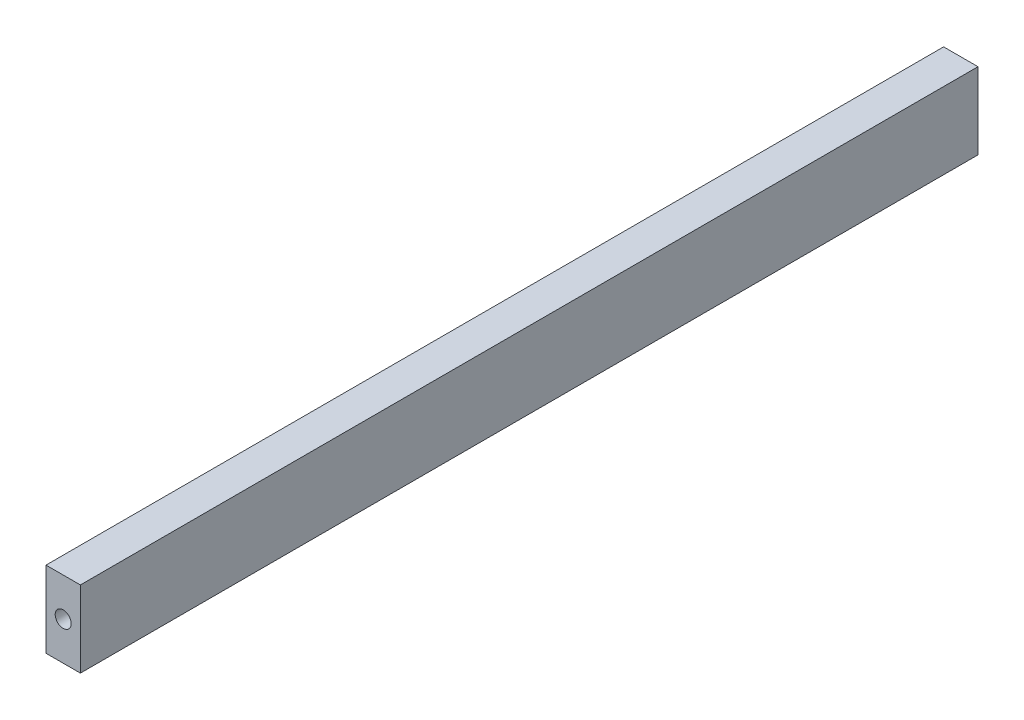
ISO-10303-21;
HEADER;
FILE_DESCRIPTION(('STEP AP214'),'2;1');
FILE_NAME('part.step','',(''),(''),'','','');
FILE_SCHEMA(('AUTOMOTIVE_DESIGN { 1 0 10303 214 1 1 1 1 }'));
ENDSEC;
DATA;
#1=APPLICATION_CONTEXT('core data for automotive mechanical design processes');
#2=APPLICATION_PROTOCOL_DEFINITION('international standard','automotive_design',2000,#1);
#3=PRODUCT_CONTEXT('',#1,'mechanical');
#4=PRODUCT('Part','Part','',(#3));
#5=PRODUCT_RELATED_PRODUCT_CATEGORY('part','',(#4));
#6=PRODUCT_DEFINITION_FORMATION('','',#4);
#7=PRODUCT_DEFINITION_CONTEXT('part definition',#1,'design');
#8=PRODUCT_DEFINITION('design','',#6,#7);
#9=PRODUCT_DEFINITION_SHAPE('','',#8);
#10=(LENGTH_UNIT() NAMED_UNIT(*) SI_UNIT(.MILLI.,.METRE.));
#11=(NAMED_UNIT(*) PLANE_ANGLE_UNIT() SI_UNIT($,.RADIAN.));
#12=(NAMED_UNIT(*) SI_UNIT($,.STERADIAN.) SOLID_ANGLE_UNIT());
#13=UNCERTAINTY_MEASURE_WITH_UNIT(LENGTH_MEASURE(1.E-05),#10,'distance_accuracy_value','');
#14=(GEOMETRIC_REPRESENTATION_CONTEXT(3) GLOBAL_UNCERTAINTY_ASSIGNED_CONTEXT((#13)) GLOBAL_UNIT_ASSIGNED_CONTEXT((#10,
#11,#12)) REPRESENTATION_CONTEXT('',''));
#15=CARTESIAN_POINT('',(0.,0.,0.));
#16=DIRECTION('',(0.,0.,1.));
#17=DIRECTION('',(1.,0.,0.));
#18=AXIS2_PLACEMENT_3D('',#15,#16,#17);
#19=CARTESIAN_POINT('',(4.5,-10.,117.5));
#20=DIRECTION('',(-1.,0.,0.));
#21=DIRECTION('',(0.,0.,1.));
#22=AXIS2_PLACEMENT_3D('',#19,#20,#21);
#23=PLANE('',#22);
#24=DIRECTION('',(0.,1.,0.));
#25=VECTOR('',#24,1.);
#26=CARTESIAN_POINT('',(4.5,-10.,-117.5));
#27=LINE('',#26,#25);
#28=CARTESIAN_POINT('',(4.5,-10.,-117.5));
#29=VERTEX_POINT('',#28);
#30=CARTESIAN_POINT('',(4.5,10.,-117.5));
#31=VERTEX_POINT('',#30);
#32=EDGE_CURVE('E111',#29,#31,#27,.T.);
#33=ORIENTED_EDGE('',*,*,#32,.T.);
#34=DIRECTION('',(0.,0.,-1.));
#35=VECTOR('',#34,1.);
#36=CARTESIAN_POINT('',(4.5,10.,117.5));
#37=LINE('',#36,#35);
#38=CARTESIAN_POINT('',(4.5,10.,117.5));
#39=VERTEX_POINT('',#38);
#40=EDGE_CURVE('E11',#39,#31,#37,.T.);
#41=ORIENTED_EDGE('',*,*,#40,.F.);
#42=DIRECTION('',(0.,1.,0.));
#43=VECTOR('',#42,1.);
#44=CARTESIAN_POINT('',(4.5,-10.,117.5));
#45=LINE('',#44,#43);
#46=CARTESIAN_POINT('',(4.5,-10.,117.5));
#47=VERTEX_POINT('',#46);
#48=EDGE_CURVE('E95',#47,#39,#45,.T.);
#49=ORIENTED_EDGE('',*,*,#48,.F.);
#50=DIRECTION('',(0.,0.,-1.));
#51=VECTOR('',#50,1.);
#52=CARTESIAN_POINT('',(4.5,-10.,117.5));
#53=LINE('',#52,#51);
#54=EDGE_CURVE('E107',#47,#29,#53,.T.);
#55=ORIENTED_EDGE('',*,*,#54,.T.);
#56=EDGE_LOOP('',(#33,#41,#49,#55));
#57=FACE_BOUND('',#56,.T.);
#58=ADVANCED_FACE('F43',(#57),#23,.F.);
#59=CARTESIAN_POINT('',(-4.5,10.,117.5));
#60=DIRECTION('',(0.,-1.,0.));
#61=DIRECTION('',(0.,0.,-1.));
#62=AXIS2_PLACEMENT_3D('',#59,#60,#61);
#63=PLANE('',#62);
#64=DIRECTION('',(-1.,0.,0.));
#65=VECTOR('',#64,1.);
#66=CARTESIAN_POINT('',(-4.5,10.,-117.5));
#67=LINE('',#66,#65);
#68=CARTESIAN_POINT('',(-4.5,10.,-117.5));
#69=VERTEX_POINT('',#68);
#70=EDGE_CURVE('E100',#31,#69,#67,.T.);
#71=ORIENTED_EDGE('',*,*,#70,.T.);
#72=DIRECTION('',(0.,0.,-1.));
#73=VECTOR('',#72,1.);
#74=CARTESIAN_POINT('',(-4.5,10.,117.5));
#75=LINE('',#74,#73);
#76=CARTESIAN_POINT('',(-4.5,10.,117.5));
#77=VERTEX_POINT('',#76);
#78=EDGE_CURVE('E52',#77,#69,#75,.T.);
#79=ORIENTED_EDGE('',*,*,#78,.F.);
#80=DIRECTION('',(-1.,0.,0.));
#81=VECTOR('',#80,1.);
#82=CARTESIAN_POINT('',(-4.5,10.,117.5));
#83=LINE('',#82,#81);
#84=EDGE_CURVE('E90',#39,#77,#83,.T.);
#85=ORIENTED_EDGE('',*,*,#84,.F.);
#86=ORIENTED_EDGE('',*,*,#40,.T.);
#87=EDGE_LOOP('',(#71,#79,#85,#86));
#88=FACE_BOUND('',#87,.T.);
#89=ADVANCED_FACE('F99',(#88),#63,.F.);
#90=CARTESIAN_POINT('',(-4.5,-10.,117.5));
#91=DIRECTION('',(1.,0.,0.));
#92=DIRECTION('',(0.,0.,-1.));
#93=AXIS2_PLACEMENT_3D('',#90,#91,#92);
#94=PLANE('',#93);
#95=DIRECTION('',(0.,-1.,0.));
#96=VECTOR('',#95,1.);
#97=CARTESIAN_POINT('',(-4.5,-10.,-117.5));
#98=LINE('',#97,#96);
#99=CARTESIAN_POINT('',(-4.5,-10.,-117.5));
#100=VERTEX_POINT('',#99);
#101=EDGE_CURVE('E77',#69,#100,#98,.T.);
#102=ORIENTED_EDGE('',*,*,#101,.T.);
#103=DIRECTION('',(0.,0.,-1.));
#104=VECTOR('',#103,1.);
#105=CARTESIAN_POINT('',(-4.5,-10.,117.5));
#106=LINE('',#105,#104);
#107=CARTESIAN_POINT('',(-4.5,-10.,117.5));
#108=VERTEX_POINT('',#107);
#109=EDGE_CURVE('E102',#108,#100,#106,.T.);
#110=ORIENTED_EDGE('',*,*,#109,.F.);
#111=DIRECTION('',(0.,-1.,0.));
#112=VECTOR('',#111,1.);
#113=CARTESIAN_POINT('',(-4.5,-10.,117.5));
#114=LINE('',#113,#112);
#115=EDGE_CURVE('E93',#77,#108,#114,.T.);
#116=ORIENTED_EDGE('',*,*,#115,.F.);
#117=ORIENTED_EDGE('',*,*,#78,.T.);
#118=EDGE_LOOP('',(#102,#110,#116,#117));
#119=FACE_BOUND('',#118,.T.);
#120=ADVANCED_FACE('F103',(#119),#94,.F.);
#121=CARTESIAN_POINT('',(-4.5,-10.,117.5));
#122=DIRECTION('',(0.,1.,0.));
#123=DIRECTION('',(0.,0.,1.));
#124=AXIS2_PLACEMENT_3D('',#121,#122,#123);
#125=PLANE('',#124);
#126=DIRECTION('',(1.,0.,0.));
#127=VECTOR('',#126,1.);
#128=CARTESIAN_POINT('',(-4.5,-10.,-117.5));
#129=LINE('',#128,#127);
#130=EDGE_CURVE('E83',#100,#29,#129,.T.);
#131=ORIENTED_EDGE('',*,*,#130,.T.);
#132=ORIENTED_EDGE('',*,*,#54,.F.);
#133=DIRECTION('',(1.,0.,0.));
#134=VECTOR('',#133,1.);
#135=CARTESIAN_POINT('',(-4.5,-10.,117.5));
#136=LINE('',#135,#134);
#137=EDGE_CURVE('E60',#108,#47,#136,.T.);
#138=ORIENTED_EDGE('',*,*,#137,.F.);
#139=ORIENTED_EDGE('',*,*,#109,.T.);
#140=EDGE_LOOP('',(#131,#132,#138,#139));
#141=FACE_BOUND('',#140,.T.);
#142=ADVANCED_FACE('F125',(#141),#125,.F.);
#143=CARTESIAN_POINT('',(0.,0.,117.5));
#144=DIRECTION('',(0.,0.,-1.));
#145=DIRECTION('',(-1.,0.,0.));
#146=AXIS2_PLACEMENT_3D('',#143,#144,#145);
#147=PLANE('',#146);
#148=CARTESIAN_POINT('',(0.,0.,117.5));
#149=DIRECTION('',(0.,0.,1.));
#150=DIRECTION('',(1.,0.,0.));
#151=AXIS2_PLACEMENT_3D('',#148,#149,#150);
#152=CIRCLE('',#151,2.1);
#153=CARTESIAN_POINT('',(2.1,0.,117.5));
#154=VERTEX_POINT('',#153);
#155=EDGE_CURVE('E132',#154,#154,#152,.T.);
#156=ORIENTED_EDGE('',*,*,#155,.F.);
#157=EDGE_LOOP('',(#156));
#158=FACE_BOUND('',#157,.T.);
#159=ORIENTED_EDGE('',*,*,#48,.T.);
#160=ORIENTED_EDGE('',*,*,#84,.T.);
#161=ORIENTED_EDGE('',*,*,#115,.T.);
#162=ORIENTED_EDGE('',*,*,#137,.T.);
#163=EDGE_LOOP('',(#159,#160,#161,#162));
#164=FACE_BOUND('',#163,.T.);
#165=ADVANCED_FACE('F91',(#158,#164),#147,.F.);
#166=CARTESIAN_POINT('',(0.,0.,-117.5));
#167=DIRECTION('',(0.,0.,-1.));
#168=DIRECTION('',(-1.,0.,0.));
#169=AXIS2_PLACEMENT_3D('',#166,#167,#168);
#170=PLANE('',#169);
#171=CARTESIAN_POINT('',(0.,0.,-117.5));
#172=DIRECTION('',(0.,0.,1.));
#173=DIRECTION('',(1.,0.,0.));
#174=AXIS2_PLACEMENT_3D('',#171,#172,#173);
#175=CIRCLE('',#174,2.1);
#176=CARTESIAN_POINT('',(2.1,0.,-117.5));
#177=VERTEX_POINT('',#176);
#178=EDGE_CURVE('E140',#177,#177,#175,.T.);
#179=ORIENTED_EDGE('',*,*,#178,.T.);
#180=EDGE_LOOP('',(#179));
#181=FACE_BOUND('',#180,.T.);
#182=ORIENTED_EDGE('',*,*,#32,.F.);
#183=ORIENTED_EDGE('',*,*,#130,.F.);
#184=ORIENTED_EDGE('',*,*,#101,.F.);
#185=ORIENTED_EDGE('',*,*,#70,.F.);
#186=EDGE_LOOP('',(#182,#183,#184,#185));
#187=FACE_BOUND('',#186,.T.);
#188=ADVANCED_FACE('F128',(#181,#187),#170,.T.);
#189=CARTESIAN_POINT('',(0.,0.,106.5));
#190=DIRECTION('',(0.,0.,1.));
#191=DIRECTION('',(1.,0.,0.));
#192=AXIS2_PLACEMENT_3D('',#189,#190,#191);
#193=CYLINDRICAL_SURFACE('',#192,2.1);
#194=CARTESIAN_POINT('',(0.,0.,106.5));
#195=DIRECTION('',(0.,0.,1.));
#196=DIRECTION('',(1.,0.,0.));
#197=AXIS2_PLACEMENT_3D('',#194,#195,#196);
#198=CIRCLE('',#197,2.1);
#199=CARTESIAN_POINT('',(2.1,0.,106.5));
#200=VERTEX_POINT('',#199);
#201=EDGE_CURVE('E115',#200,#200,#198,.T.);
#202=ORIENTED_EDGE('',*,*,#201,.F.);
#203=EDGE_LOOP('',(#202));
#204=FACE_BOUND('',#203,.T.);
#205=ORIENTED_EDGE('',*,*,#155,.T.);
#206=EDGE_LOOP('',(#205));
#207=FACE_BOUND('',#206,.T.);
#208=ADVANCED_FACE('F172',(#204,#207),#193,.F.);
#209=CARTESIAN_POINT('',(0.,0.,106.5));
#210=DIRECTION('',(0.,0.,1.));
#211=DIRECTION('',(1.,0.,0.));
#212=AXIS2_PLACEMENT_3D('',#209,#210,#211);
#213=PLANE('',#212);
#214=ORIENTED_EDGE('',*,*,#201,.T.);
#215=EDGE_LOOP('',(#214));
#216=FACE_BOUND('',#215,.T.);
#217=ADVANCED_FACE('F157',(#216),#213,.T.);
#218=CARTESIAN_POINT('',(0.,0.,-106.5));
#219=DIRECTION('',(0.,0.,-1.));
#220=DIRECTION('',(-1.,0.,0.));
#221=AXIS2_PLACEMENT_3D('',#218,#219,#220);
#222=CYLINDRICAL_SURFACE('',#221,2.1);
#223=CARTESIAN_POINT('',(0.,0.,-106.5));
#224=DIRECTION('',(0.,0.,1.));
#225=DIRECTION('',(1.,0.,0.));
#226=AXIS2_PLACEMENT_3D('',#223,#224,#225);
#227=CIRCLE('',#226,2.1);
#228=CARTESIAN_POINT('',(2.1,0.,-106.5));
#229=VERTEX_POINT('',#228);
#230=EDGE_CURVE('E136',#229,#229,#227,.T.);
#231=ORIENTED_EDGE('',*,*,#230,.T.);
#232=EDGE_LOOP('',(#231));
#233=FACE_BOUND('',#232,.T.);
#234=ORIENTED_EDGE('',*,*,#178,.F.);
#235=EDGE_LOOP('',(#234));
#236=FACE_BOUND('',#235,.T.);
#237=ADVANCED_FACE('F148',(#233,#236),#222,.F.);
#238=CARTESIAN_POINT('',(0.,0.,-106.5));
#239=DIRECTION('',(0.,0.,-1.));
#240=DIRECTION('',(1.,0.,0.));
#241=AXIS2_PLACEMENT_3D('',#238,#239,#240);
#242=PLANE('',#241);
#243=ORIENTED_EDGE('',*,*,#230,.F.);
#244=EDGE_LOOP('',(#243));
#245=FACE_BOUND('',#244,.T.);
#246=ADVANCED_FACE('F151',(#245),#242,.T.);
#247=CLOSED_SHELL('',(#58,#89,#120,#142,#165,#188,#208,#217,#237,#246));
#248=MANIFOLD_SOLID_BREP('B2',#247);
#249=ADVANCED_BREP_SHAPE_REPRESENTATION('',(#18,#248),#14);
#250=SHAPE_DEFINITION_REPRESENTATION(#9,#249);
ENDSEC;
END-ISO-10303-21;
